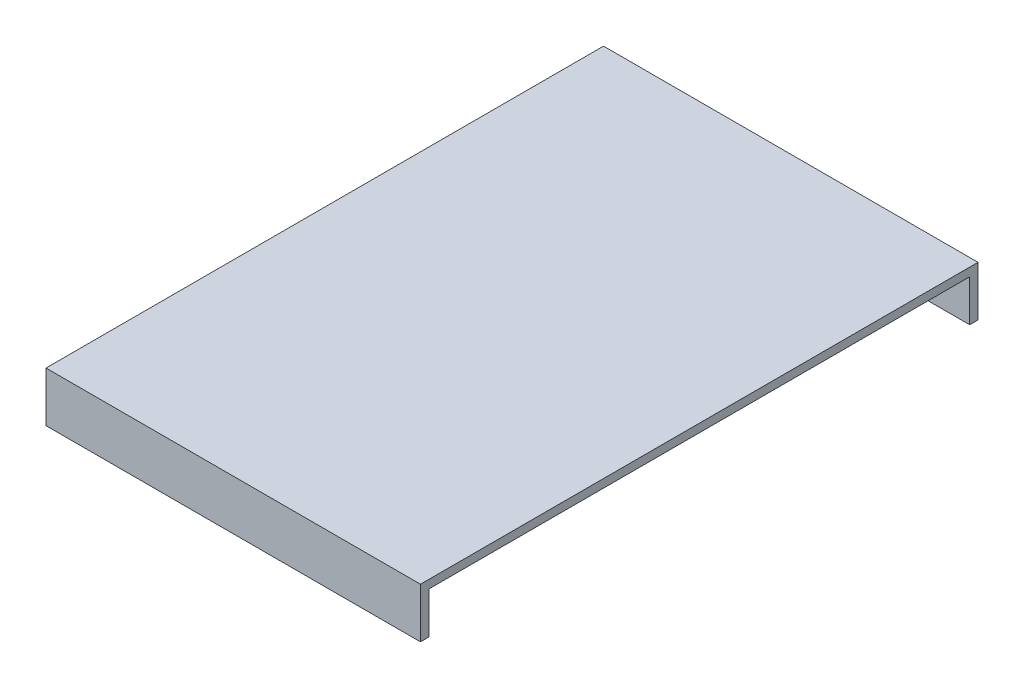
ISO-10303-21;
HEADER;
FILE_DESCRIPTION(('STEP AP214'),'2;1');
FILE_NAME('part.step','',(''),(''),'','','');
FILE_SCHEMA(('AUTOMOTIVE_DESIGN { 1 0 10303 214 1 1 1 1 }'));
ENDSEC;
DATA;
#1=APPLICATION_CONTEXT('core data for automotive mechanical design processes');
#2=APPLICATION_PROTOCOL_DEFINITION('international standard','automotive_design',2000,#1);
#3=PRODUCT_CONTEXT('',#1,'mechanical');
#4=PRODUCT('Part','Part','',(#3));
#5=PRODUCT_RELATED_PRODUCT_CATEGORY('part','',(#4));
#6=PRODUCT_DEFINITION_FORMATION('','',#4);
#7=PRODUCT_DEFINITION_CONTEXT('part definition',#1,'design');
#8=PRODUCT_DEFINITION('design','',#6,#7);
#9=PRODUCT_DEFINITION_SHAPE('','',#8);
#10=(LENGTH_UNIT() NAMED_UNIT(*) SI_UNIT(.MILLI.,.METRE.));
#11=(NAMED_UNIT(*) PLANE_ANGLE_UNIT() SI_UNIT($,.RADIAN.));
#12=(NAMED_UNIT(*) SI_UNIT($,.STERADIAN.) SOLID_ANGLE_UNIT());
#13=UNCERTAINTY_MEASURE_WITH_UNIT(LENGTH_MEASURE(1.E-05),#10,'distance_accuracy_value','');
#14=(GEOMETRIC_REPRESENTATION_CONTEXT(3) GLOBAL_UNCERTAINTY_ASSIGNED_CONTEXT((#13)) GLOBAL_UNIT_ASSIGNED_CONTEXT((#10,
#11,#12)) REPRESENTATION_CONTEXT('',''));
#15=CARTESIAN_POINT('',(0.,0.,0.));
#16=DIRECTION('',(0.,0.,1.));
#17=DIRECTION('',(1.,0.,0.));
#18=AXIS2_PLACEMENT_3D('',#15,#16,#17);
#19=CARTESIAN_POINT('',(-0.5,2.,-69.8510638297873));
#20=DIRECTION('',(0.,0.,1.));
#21=DIRECTION('',(1.,0.,0.));
#22=AXIS2_PLACEMENT_3D('',#19,#20,#21);
#23=PLANE('',#22);
#24=DIRECTION('',(0.,-1.,0.));
#25=VECTOR('',#24,1.);
#26=CARTESIAN_POINT('',(45.,2.,-69.8510638297873));
#27=LINE('',#26,#25);
#28=CARTESIAN_POINT('',(45.,2.,-69.8510638297873));
#29=VERTEX_POINT('',#28);
#30=CARTESIAN_POINT('',(45.,-10.,-69.8510638297873));
#31=VERTEX_POINT('',#30);
#32=EDGE_CURVE('E180',#29,#31,#27,.T.);
#33=ORIENTED_EDGE('',*,*,#32,.T.);
#34=DIRECTION('',(-1.,0.,0.));
#35=VECTOR('',#34,1.);
#36=CARTESIAN_POINT('',(45.,-10.,-69.8510638297873));
#37=LINE('',#36,#35);
#38=CARTESIAN_POINT('',(-45.,-10.,-69.8510638297873));
#39=VERTEX_POINT('',#38);
#40=EDGE_CURVE('E138',#31,#39,#37,.T.);
#41=ORIENTED_EDGE('',*,*,#40,.T.);
#42=DIRECTION('',(0.,-1.,0.));
#43=VECTOR('',#42,1.);
#44=CARTESIAN_POINT('',(-45.,2.,-69.8510638297873));
#45=LINE('',#44,#43);
#46=CARTESIAN_POINT('',(-45.,2.,-69.8510638297873));
#47=VERTEX_POINT('',#46);
#48=EDGE_CURVE('E11',#47,#39,#45,.T.);
#49=ORIENTED_EDGE('',*,*,#48,.F.);
#50=DIRECTION('',(-1.,0.,0.));
#51=VECTOR('',#50,1.);
#52=CARTESIAN_POINT('',(45.,2.,-69.8510638297873));
#53=LINE('',#52,#51);
#54=EDGE_CURVE('E153',#29,#47,#53,.T.);
#55=ORIENTED_EDGE('',*,*,#54,.F.);
#56=EDGE_LOOP('',(#33,#41,#49,#55));
#57=FACE_BOUND('',#56,.T.);
#58=ADVANCED_FACE('F37',(#57),#23,.F.);
#59=CARTESIAN_POINT('',(-45.,2.,-69.8510638297873));
#60=DIRECTION('',(1.,0.,0.));
#61=DIRECTION('',(0.,0.,-1.));
#62=AXIS2_PLACEMENT_3D('',#59,#60,#61);
#63=PLANE('',#62);
#64=ORIENTED_EDGE('',*,*,#48,.T.);
#65=DIRECTION('',(0.,0.,1.));
#66=VECTOR('',#65,1.);
#67=CARTESIAN_POINT('',(-45.,-10.,-69.8510638297873));
#68=LINE('',#67,#66);
#69=CARTESIAN_POINT('',(-45.,-10.,-67.8510638297872));
#70=VERTEX_POINT('',#69);
#71=EDGE_CURVE('E141',#39,#70,#68,.T.);
#72=ORIENTED_EDGE('',*,*,#71,.T.);
#73=DIRECTION('',(0.,1.,0.));
#74=VECTOR('',#73,1.);
#75=CARTESIAN_POINT('',(-45.,-10.,-67.8510638297872));
#76=LINE('',#75,#74);
#77=CARTESIAN_POINT('',(-45.,0.,-67.8510638297872));
#78=VERTEX_POINT('',#77);
#79=EDGE_CURVE('E150',#70,#78,#76,.T.);
#80=ORIENTED_EDGE('',*,*,#79,.T.);
#81=DIRECTION('',(0.,0.,1.));
#82=VECTOR('',#81,1.);
#83=CARTESIAN_POINT('',(-45.,0.,-69.8510638297873));
#84=LINE('',#83,#82);
#85=CARTESIAN_POINT('',(-45.,0.,62.1489361702128));
#86=VERTEX_POINT('',#85);
#87=EDGE_CURVE('E159',#78,#86,#84,.T.);
#88=ORIENTED_EDGE('',*,*,#87,.T.);
#89=DIRECTION('',(0.,1.,0.));
#90=VECTOR('',#89,1.);
#91=CARTESIAN_POINT('',(-45.,-10.,62.1489361702128));
#92=LINE('',#91,#90);
#93=CARTESIAN_POINT('',(-45.,-10.,62.1489361702128));
#94=VERTEX_POINT('',#93);
#95=EDGE_CURVE('E125',#94,#86,#92,.T.);
#96=ORIENTED_EDGE('',*,*,#95,.F.);
#97=DIRECTION('',(0.,0.,1.));
#98=VECTOR('',#97,1.);
#99=CARTESIAN_POINT('',(-45.,-10.,62.1489361702128));
#100=LINE('',#99,#98);
#101=CARTESIAN_POINT('',(-45.,-10.,64.1489361702128));
#102=VERTEX_POINT('',#101);
#103=EDGE_CURVE('E118',#94,#102,#100,.T.);
#104=ORIENTED_EDGE('',*,*,#103,.T.);
#105=DIRECTION('',(0.,-1.,0.));
#106=VECTOR('',#105,1.);
#107=CARTESIAN_POINT('',(-45.,2.,64.1489361702128));
#108=LINE('',#107,#106);
#109=CARTESIAN_POINT('',(-45.,2.,64.1489361702128));
#110=VERTEX_POINT('',#109);
#111=EDGE_CURVE('E46',#110,#102,#108,.T.);
#112=ORIENTED_EDGE('',*,*,#111,.F.);
#113=DIRECTION('',(0.,0.,1.));
#114=VECTOR('',#113,1.);
#115=CARTESIAN_POINT('',(-45.,2.,-69.8510638297873));
#116=LINE('',#115,#114);
#117=EDGE_CURVE('E175',#47,#110,#116,.T.);
#118=ORIENTED_EDGE('',*,*,#117,.F.);
#119=EDGE_LOOP('',(#64,#72,#80,#88,#96,#104,#112,#118));
#120=FACE_BOUND('',#119,.T.);
#121=ADVANCED_FACE('F123',(#120),#63,.F.);
#122=CARTESIAN_POINT('',(-45.,2.,64.1489361702128));
#123=DIRECTION('',(0.,0.,-1.));
#124=DIRECTION('',(-1.,0.,0.));
#125=AXIS2_PLACEMENT_3D('',#122,#123,#124);
#126=PLANE('',#125);
#127=ORIENTED_EDGE('',*,*,#111,.T.);
#128=DIRECTION('',(1.,0.,0.));
#129=VECTOR('',#128,1.);
#130=CARTESIAN_POINT('',(-45.,-10.,64.1489361702128));
#131=LINE('',#130,#129);
#132=CARTESIAN_POINT('',(45.,-10.,64.1489361702128));
#133=VERTEX_POINT('',#132);
#134=EDGE_CURVE('E106',#102,#133,#131,.T.);
#135=ORIENTED_EDGE('',*,*,#134,.T.);
#136=DIRECTION('',(0.,-1.,0.));
#137=VECTOR('',#136,1.);
#138=CARTESIAN_POINT('',(45.,2.,64.1489361702128));
#139=LINE('',#138,#137);
#140=CARTESIAN_POINT('',(45.,2.,64.1489361702128));
#141=VERTEX_POINT('',#140);
#142=EDGE_CURVE('E111',#141,#133,#139,.T.);
#143=ORIENTED_EDGE('',*,*,#142,.F.);
#144=DIRECTION('',(1.,0.,0.));
#145=VECTOR('',#144,1.);
#146=CARTESIAN_POINT('',(-45.,2.,64.1489361702128));
#147=LINE('',#146,#145);
#148=EDGE_CURVE('E107',#110,#141,#147,.T.);
#149=ORIENTED_EDGE('',*,*,#148,.F.);
#150=EDGE_LOOP('',(#127,#135,#143,#149));
#151=FACE_BOUND('',#150,.T.);
#152=ADVANCED_FACE('F104',(#151),#126,.F.);
#153=CARTESIAN_POINT('',(45.,2.,64.1489361702128));
#154=DIRECTION('',(-1.,0.,0.));
#155=DIRECTION('',(0.,0.,1.));
#156=AXIS2_PLACEMENT_3D('',#153,#154,#155);
#157=PLANE('',#156);
#158=ORIENTED_EDGE('',*,*,#142,.T.);
#159=DIRECTION('',(0.,0.,-1.));
#160=VECTOR('',#159,1.);
#161=CARTESIAN_POINT('',(45.,-10.,64.1489361702128));
#162=LINE('',#161,#160);
#163=CARTESIAN_POINT('',(45.,-10.,62.1489361702128));
#164=VERTEX_POINT('',#163);
#165=EDGE_CURVE('E121',#133,#164,#162,.T.);
#166=ORIENTED_EDGE('',*,*,#165,.T.);
#167=DIRECTION('',(0.,1.,0.));
#168=VECTOR('',#167,1.);
#169=CARTESIAN_POINT('',(45.,-10.,62.1489361702128));
#170=LINE('',#169,#168);
#171=CARTESIAN_POINT('',(45.,0.,62.1489361702128));
#172=VERTEX_POINT('',#171);
#173=EDGE_CURVE('E133',#164,#172,#170,.T.);
#174=ORIENTED_EDGE('',*,*,#173,.T.);
#175=DIRECTION('',(0.,0.,-1.));
#176=VECTOR('',#175,1.);
#177=CARTESIAN_POINT('',(45.,0.,64.1489361702128));
#178=LINE('',#177,#176);
#179=CARTESIAN_POINT('',(45.,0.,-67.8510638297872));
#180=VERTEX_POINT('',#179);
#181=EDGE_CURVE('E40',#172,#180,#178,.T.);
#182=ORIENTED_EDGE('',*,*,#181,.T.);
#183=DIRECTION('',(0.,1.,0.));
#184=VECTOR('',#183,1.);
#185=CARTESIAN_POINT('',(45.,-10.,-67.8510638297872));
#186=LINE('',#185,#184);
#187=CARTESIAN_POINT('',(45.,-10.,-67.8510638297872));
#188=VERTEX_POINT('',#187);
#189=EDGE_CURVE('E161',#188,#180,#186,.T.);
#190=ORIENTED_EDGE('',*,*,#189,.F.);
#191=DIRECTION('',(0.,0.,-1.));
#192=VECTOR('',#191,1.);
#193=CARTESIAN_POINT('',(45.,-10.,-69.8510638297873));
#194=LINE('',#193,#192);
#195=EDGE_CURVE('E147',#188,#31,#194,.T.);
#196=ORIENTED_EDGE('',*,*,#195,.T.);
#197=ORIENTED_EDGE('',*,*,#32,.F.);
#198=DIRECTION('',(0.,0.,-1.));
#199=VECTOR('',#198,1.);
#200=CARTESIAN_POINT('',(45.,2.,64.1489361702128));
#201=LINE('',#200,#199);
#202=EDGE_CURVE('E61',#141,#29,#201,.T.);
#203=ORIENTED_EDGE('',*,*,#202,.F.);
#204=EDGE_LOOP('',(#158,#166,#174,#182,#190,#196,#197,#203));
#205=FACE_BOUND('',#204,.T.);
#206=ADVANCED_FACE('F185',(#205),#157,.F.);
#207=CARTESIAN_POINT('',(0.,2.,0.));
#208=DIRECTION('',(0.,1.,0.));
#209=DIRECTION('',(0.,0.,1.));
#210=AXIS2_PLACEMENT_3D('',#207,#208,#209);
#211=PLANE('',#210);
#212=ORIENTED_EDGE('',*,*,#54,.T.);
#213=ORIENTED_EDGE('',*,*,#117,.T.);
#214=ORIENTED_EDGE('',*,*,#148,.T.);
#215=ORIENTED_EDGE('',*,*,#202,.T.);
#216=EDGE_LOOP('',(#212,#213,#214,#215));
#217=FACE_BOUND('',#216,.T.);
#218=ADVANCED_FACE('F212',(#217),#211,.T.);
#219=CARTESIAN_POINT('',(0.,0.,0.));
#220=DIRECTION('',(0.,1.,0.));
#221=DIRECTION('',(0.,0.,1.));
#222=AXIS2_PLACEMENT_3D('',#219,#220,#221);
#223=PLANE('',#222);
#224=ORIENTED_EDGE('',*,*,#181,.F.);
#225=DIRECTION('',(-1.,0.,0.));
#226=VECTOR('',#225,1.);
#227=CARTESIAN_POINT('',(45.,0.,62.1489361702128));
#228=LINE('',#227,#226);
#229=EDGE_CURVE('E126',#172,#86,#228,.T.);
#230=ORIENTED_EDGE('',*,*,#229,.T.);
#231=ORIENTED_EDGE('',*,*,#87,.F.);
#232=DIRECTION('',(1.,0.,0.));
#233=VECTOR('',#232,1.);
#234=CARTESIAN_POINT('',(-45.,0.,-67.8510638297872));
#235=LINE('',#234,#233);
#236=EDGE_CURVE('E136',#78,#180,#235,.T.);
#237=ORIENTED_EDGE('',*,*,#236,.T.);
#238=EDGE_LOOP('',(#224,#230,#231,#237));
#239=FACE_BOUND('',#238,.T.);
#240=ADVANCED_FACE('F173',(#239),#223,.F.);
#241=CARTESIAN_POINT('',(-45.,-10.,-67.8510638297872));
#242=DIRECTION('',(0.,0.,1.));
#243=DIRECTION('',(1.,0.,0.));
#244=AXIS2_PLACEMENT_3D('',#241,#242,#243);
#245=PLANE('',#244);
#246=ORIENTED_EDGE('',*,*,#236,.F.);
#247=ORIENTED_EDGE('',*,*,#79,.F.);
#248=DIRECTION('',(1.,0.,0.));
#249=VECTOR('',#248,1.);
#250=CARTESIAN_POINT('',(-45.,-10.,-67.8510638297872));
#251=LINE('',#250,#249);
#252=EDGE_CURVE('E144',#70,#188,#251,.T.);
#253=ORIENTED_EDGE('',*,*,#252,.T.);
#254=ORIENTED_EDGE('',*,*,#189,.T.);
#255=EDGE_LOOP('',(#246,#247,#253,#254));
#256=FACE_BOUND('',#255,.T.);
#257=ADVANCED_FACE('F171',(#256),#245,.T.);
#258=CARTESIAN_POINT('',(0.,-10.,0.));
#259=DIRECTION('',(0.,1.,0.));
#260=DIRECTION('',(0.,0.,1.));
#261=AXIS2_PLACEMENT_3D('',#258,#259,#260);
#262=PLANE('',#261);
#263=ORIENTED_EDGE('',*,*,#40,.F.);
#264=ORIENTED_EDGE('',*,*,#195,.F.);
#265=ORIENTED_EDGE('',*,*,#252,.F.);
#266=ORIENTED_EDGE('',*,*,#71,.F.);
#267=EDGE_LOOP('',(#263,#264,#265,#266));
#268=FACE_BOUND('',#267,.T.);
#269=ADVANCED_FACE('F190',(#268),#262,.F.);
#270=CARTESIAN_POINT('',(45.,-10.,62.1489361702128));
#271=DIRECTION('',(0.,0.,-1.));
#272=DIRECTION('',(-1.,0.,0.));
#273=AXIS2_PLACEMENT_3D('',#270,#271,#272);
#274=PLANE('',#273);
#275=ORIENTED_EDGE('',*,*,#229,.F.);
#276=ORIENTED_EDGE('',*,*,#173,.F.);
#277=DIRECTION('',(-1.,0.,0.));
#278=VECTOR('',#277,1.);
#279=CARTESIAN_POINT('',(45.,-10.,62.1489361702128));
#280=LINE('',#279,#278);
#281=EDGE_CURVE('E132',#164,#94,#280,.T.);
#282=ORIENTED_EDGE('',*,*,#281,.T.);
#283=ORIENTED_EDGE('',*,*,#95,.T.);
#284=EDGE_LOOP('',(#275,#276,#282,#283));
#285=FACE_BOUND('',#284,.T.);
#286=ADVANCED_FACE('F192',(#285),#274,.T.);
#287=CARTESIAN_POINT('',(0.,-10.,0.));
#288=DIRECTION('',(0.,1.,0.));
#289=DIRECTION('',(0.,0.,1.));
#290=AXIS2_PLACEMENT_3D('',#287,#288,#289);
#291=PLANE('',#290);
#292=ORIENTED_EDGE('',*,*,#103,.F.);
#293=ORIENTED_EDGE('',*,*,#281,.F.);
#294=ORIENTED_EDGE('',*,*,#165,.F.);
#295=ORIENTED_EDGE('',*,*,#134,.F.);
#296=EDGE_LOOP('',(#292,#293,#294,#295));
#297=FACE_BOUND('',#296,.T.);
#298=ADVANCED_FACE('F116',(#297),#291,.F.);
#299=CLOSED_SHELL('',(#58,#121,#152,#206,#218,#240,#257,#269,#286,#298));
#300=MANIFOLD_SOLID_BREP('B2',#299);
#301=ADVANCED_BREP_SHAPE_REPRESENTATION('',(#18,#300),#14);
#302=SHAPE_DEFINITION_REPRESENTATION(#9,#301);
ENDSEC;
END-ISO-10303-21;
